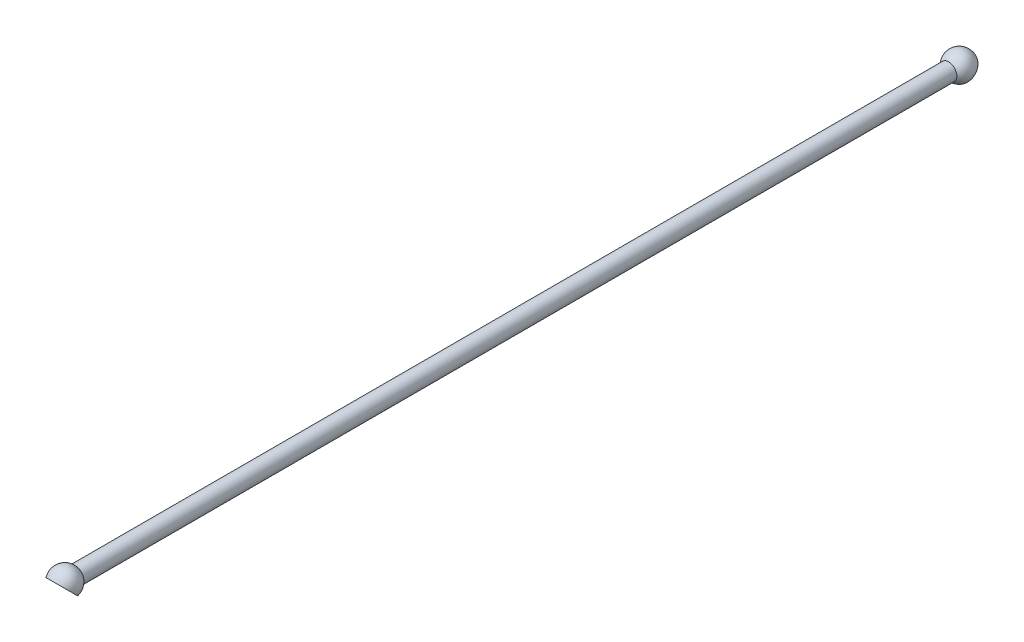
ISO-10303-21;
HEADER;
FILE_DESCRIPTION(('STEP AP214'),'2;1');
FILE_NAME('part.step','',(''),(''),'','','');
FILE_SCHEMA(('AUTOMOTIVE_DESIGN { 1 0 10303 214 1 1 1 1 }'));
ENDSEC;
DATA;
#1=APPLICATION_CONTEXT('core data for automotive mechanical design processes');
#2=APPLICATION_PROTOCOL_DEFINITION('international standard','automotive_design',2000,#1);
#3=PRODUCT_CONTEXT('',#1,'mechanical');
#4=PRODUCT('Part','Part','',(#3));
#5=PRODUCT_RELATED_PRODUCT_CATEGORY('part','',(#4));
#6=PRODUCT_DEFINITION_FORMATION('','',#4);
#7=PRODUCT_DEFINITION_CONTEXT('part definition',#1,'design');
#8=PRODUCT_DEFINITION('design','',#6,#7);
#9=PRODUCT_DEFINITION_SHAPE('','',#8);
#10=(LENGTH_UNIT() NAMED_UNIT(*) SI_UNIT(.MILLI.,.METRE.));
#11=(NAMED_UNIT(*) PLANE_ANGLE_UNIT() SI_UNIT($,.RADIAN.));
#12=(NAMED_UNIT(*) SI_UNIT($,.STERADIAN.) SOLID_ANGLE_UNIT());
#13=UNCERTAINTY_MEASURE_WITH_UNIT(LENGTH_MEASURE(1.E-05),#10,'distance_accuracy_value','');
#14=(GEOMETRIC_REPRESENTATION_CONTEXT(3) GLOBAL_UNCERTAINTY_ASSIGNED_CONTEXT((#13)) GLOBAL_UNIT_ASSIGNED_CONTEXT((#10,
#11,#12)) REPRESENTATION_CONTEXT('',''));
#15=CARTESIAN_POINT('',(0.,0.,0.));
#16=DIRECTION('',(0.,0.,1.));
#17=DIRECTION('',(1.,0.,0.));
#18=AXIS2_PLACEMENT_3D('',#15,#16,#17);
#19=CARTESIAN_POINT('',(0.,0.,-214.080811107336));
#20=DIRECTION('',(0.,0.,-1.));
#21=DIRECTION('',(0.,1.,0.));
#22=AXIS2_PLACEMENT_3D('',#19,#20,#21);
#23=SPHERICAL_SURFACE('',#22,6.50000000000001);
#24=CARTESIAN_POINT('',(0.,0.,-208.957335724357));
#25=DIRECTION('',(0.,0.,-0.999999999999999));
#26=DIRECTION('',(-1.,0.,0.));
#27=AXIS2_PLACEMENT_3D('',#24,#25,#26);
#28=CIRCLE('',#27,4.);
#29=CARTESIAN_POINT('',(-4.,0.,-208.957335724357));
#30=VERTEX_POINT('',#29);
#31=EDGE_CURVE('E10',#30,#30,#28,.T.);
#32=ORIENTED_EDGE('',*,*,#31,.T.);
#33=EDGE_LOOP('',(#32));
#34=FACE_BOUND('',#33,.T.);
#35=CARTESIAN_POINT('',(0.,-1.41421356237309,-215.495024669709));
#36=DIRECTION('',(0.,-0.707106781186551,-0.707106781186544));
#37=DIRECTION('',(0.,0.707106781186544,-0.707106781186551));
#38=AXIS2_PLACEMENT_3D('',#35,#36,#37);
#39=CIRCLE('',#38,6.1846584384265);
#40=CARTESIAN_POINT('',(0.,2.95900035876086,-219.868238590843));
#41=VERTEX_POINT('',#40);
#42=EDGE_CURVE('E55',#41,#41,#39,.T.);
#43=ORIENTED_EDGE('',*,*,#42,.F.);
#44=EDGE_LOOP('',(#43));
#45=FACE_BOUND('',#44,.T.);
#46=ADVANCED_FACE('F37',(#34,#45),#23,.T.);
#47=CARTESIAN_POINT('',(0.,0.,214.080811107336));
#48=DIRECTION('',(0.,0.,-1.));
#49=DIRECTION('',(-1.,0.,0.));
#50=AXIS2_PLACEMENT_3D('',#47,#48,#49);
#51=CYLINDRICAL_SURFACE('',#50,4.);
#52=CARTESIAN_POINT('',(0.,0.,208.957335724357));
#53=DIRECTION('',(0.,0.,0.999999999999999));
#54=DIRECTION('',(1.,0.,0.));
#55=AXIS2_PLACEMENT_3D('',#52,#53,#54);
#56=CIRCLE('',#55,4.);
#57=CARTESIAN_POINT('',(4.,0.,208.957335724357));
#58=VERTEX_POINT('',#57);
#59=EDGE_CURVE('E45',#58,#58,#56,.T.);
#60=ORIENTED_EDGE('',*,*,#59,.F.);
#61=EDGE_LOOP('',(#60));
#62=FACE_BOUND('',#61,.T.);
#63=ORIENTED_EDGE('',*,*,#31,.F.);
#64=EDGE_LOOP('',(#63));
#65=FACE_BOUND('',#64,.T.);
#66=ADVANCED_FACE('F39',(#62,#65),#51,.T.);
#67=CARTESIAN_POINT('',(0.,0.,214.080811107336));
#68=DIRECTION('',(0.,0.,1.));
#69=DIRECTION('',(0.,1.,0.));
#70=AXIS2_PLACEMENT_3D('',#67,#68,#69);
#71=SPHERICAL_SURFACE('',#70,6.50000000000001);
#72=CARTESIAN_POINT('',(0.,-1.41421356237309,215.495024669709));
#73=DIRECTION('',(0.,0.707106781186551,-0.707106781186544));
#74=DIRECTION('',(0.,0.707106781186544,0.707106781186551));
#75=AXIS2_PLACEMENT_3D('',#72,#73,#74);
#76=CIRCLE('',#75,6.1846584384265);
#77=CARTESIAN_POINT('',(0.,2.95900035876086,219.868238590843));
#78=VERTEX_POINT('',#77);
#79=EDGE_CURVE('E50',#78,#78,#76,.T.);
#80=ORIENTED_EDGE('',*,*,#79,.T.);
#81=EDGE_LOOP('',(#80));
#82=FACE_BOUND('',#81,.T.);
#83=ORIENTED_EDGE('',*,*,#59,.T.);
#84=EDGE_LOOP('',(#83));
#85=FACE_BOUND('',#84,.T.);
#86=ADVANCED_FACE('F78',(#82,#85),#71,.T.);
#87=CARTESIAN_POINT('',(-10.,5.08578643762688,221.995024669709));
#88=DIRECTION('',(0.,0.707106781186551,-0.707106781186544));
#89=DIRECTION('',(0.,0.707106781186544,0.707106781186551));
#90=AXIS2_PLACEMENT_3D('',#87,#88,#89);
#91=PLANE('',#90);
#92=CARTESIAN_POINT('',(0.,-1.41421356237309,215.495024669709));
#93=DIRECTION('',(0.,0.707106781186551,-0.707106781186544));
#94=DIRECTION('',(0.,0.707106781186544,0.707106781186551));
#95=AXIS2_PLACEMENT_3D('',#92,#93,#94);
#96=CIRCLE('',#95,4.58257569495585);
#97=CARTESIAN_POINT('',(0.,1.82615678683082,218.735395018913));
#98=VERTEX_POINT('',#97);
#99=EDGE_CURVE('E53',#98,#98,#96,.F.);
#100=ORIENTED_EDGE('',*,*,#99,.F.);
#101=EDGE_LOOP('',(#100));
#102=FACE_BOUND('',#101,.T.);
#103=ORIENTED_EDGE('',*,*,#79,.F.);
#104=EDGE_LOOP('',(#103));
#105=FACE_BOUND('',#104,.T.);
#106=ADVANCED_FACE('F84',(#102,#105),#91,.F.);
#107=CARTESIAN_POINT('',(0.,0.,214.080811107336));
#108=DIRECTION('',(0.,0.,-1.));
#109=DIRECTION('',(1.,0.,0.));
#110=AXIS2_PLACEMENT_3D('',#107,#108,#109);
#111=SPHERICAL_SURFACE('',#110,5.);
#112=CARTESIAN_POINT('',(0.,0.,214.080811107336));
#113=DIRECTION('',(0.,0.707106781186551,-0.707106781186544));
#114=DIRECTION('',(0.,0.707106781186544,0.707106781186551));
#115=AXIS2_PLACEMENT_3D('',#112,#113,#114);
#116=SPHERICAL_SURFACE('',#115,5.);
#117=ORIENTED_EDGE('',*,*,#99,.T.);
#118=EDGE_LOOP('',(#117));
#119=FACE_BOUND('',#118,.T.);
#120=ADVANCED_FACE('F71',(#119),#116,.F.);
#121=CARTESIAN_POINT('',(-10.,5.08578643762688,-221.995024669709));
#122=DIRECTION('',(0.,-0.707106781186551,-0.707106781186544));
#123=DIRECTION('',(0.,0.707106781186544,-0.707106781186551));
#124=AXIS2_PLACEMENT_3D('',#121,#122,#123);
#125=PLANE('',#124);
#126=CARTESIAN_POINT('',(0.,-1.41421356237309,-215.495024669709));
#127=DIRECTION('',(0.,-0.707106781186551,-0.707106781186544));
#128=DIRECTION('',(0.,0.707106781186544,-0.707106781186551));
#129=AXIS2_PLACEMENT_3D('',#126,#127,#128);
#130=CIRCLE('',#129,4.58257569495585);
#131=CARTESIAN_POINT('',(0.,1.82615678683082,-218.735395018913));
#132=VERTEX_POINT('',#131);
#133=EDGE_CURVE('E41',#132,#132,#130,.F.);
#134=ORIENTED_EDGE('',*,*,#133,.T.);
#135=EDGE_LOOP('',(#134));
#136=FACE_BOUND('',#135,.T.);
#137=ORIENTED_EDGE('',*,*,#42,.T.);
#138=EDGE_LOOP('',(#137));
#139=FACE_BOUND('',#138,.T.);
#140=ADVANCED_FACE('F63',(#136,#139),#125,.T.);
#141=CARTESIAN_POINT('',(0.,0.,-214.080811107336));
#142=DIRECTION('',(0.,0.,1.));
#143=DIRECTION('',(1.,0.,0.));
#144=AXIS2_PLACEMENT_3D('',#141,#142,#143);
#145=SPHERICAL_SURFACE('',#144,5.);
#146=CARTESIAN_POINT('',(0.,0.,-214.080811107336));
#147=DIRECTION('',(0.,-0.707106781186551,-0.707106781186544));
#148=DIRECTION('',(0.,0.707106781186544,-0.707106781186551));
#149=AXIS2_PLACEMENT_3D('',#146,#147,#148);
#150=SPHERICAL_SURFACE('',#149,5.);
#151=ORIENTED_EDGE('',*,*,#133,.F.);
#152=EDGE_LOOP('',(#151));
#153=FACE_BOUND('',#152,.T.);
#154=ADVANCED_FACE('F65',(#153),#150,.F.);
#155=CLOSED_SHELL('',(#46,#66,#86,#106,#120,#140,#154));
#156=MANIFOLD_SOLID_BREP('B2',#155);
#157=ADVANCED_BREP_SHAPE_REPRESENTATION('',(#18,#156),#14);
#158=SHAPE_DEFINITION_REPRESENTATION(#9,#157);
ENDSEC;
END-ISO-10303-21;
